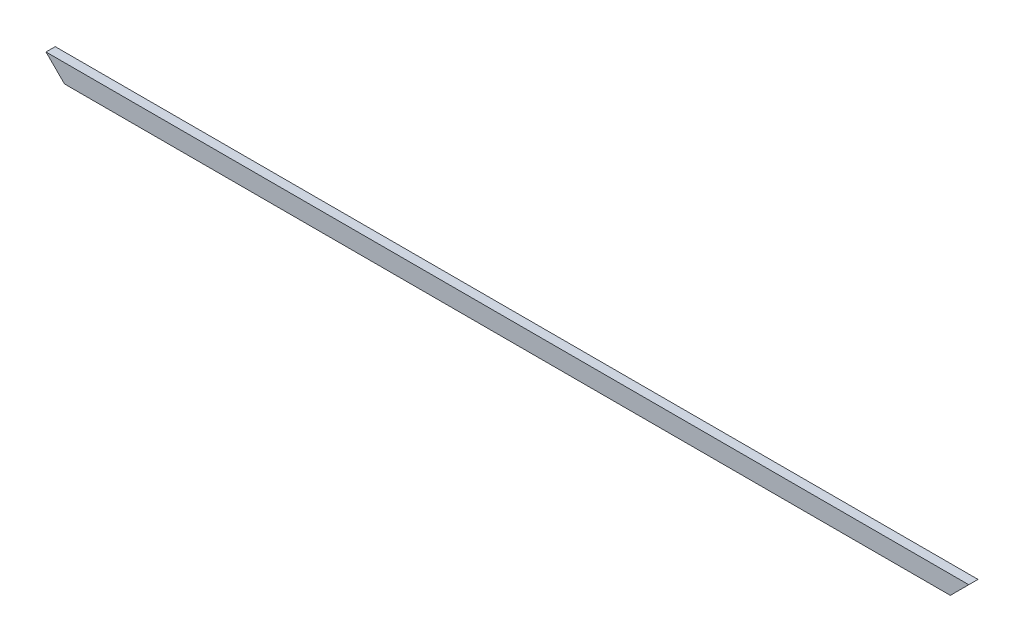
ISO-10303-21;
HEADER;
FILE_DESCRIPTION(('STEP AP214'),'2;1');
FILE_NAME('part.step','',(''),(''),'','','');
FILE_SCHEMA(('AUTOMOTIVE_DESIGN { 1 0 10303 214 1 1 1 1 }'));
ENDSEC;
DATA;
#1=APPLICATION_CONTEXT('core data for automotive mechanical design processes');
#2=APPLICATION_PROTOCOL_DEFINITION('international standard','automotive_design',2000,#1);
#3=PRODUCT_CONTEXT('',#1,'mechanical');
#4=PRODUCT('Part','Part','',(#3));
#5=PRODUCT_RELATED_PRODUCT_CATEGORY('part','',(#4));
#6=PRODUCT_DEFINITION_FORMATION('','',#4);
#7=PRODUCT_DEFINITION_CONTEXT('part definition',#1,'design');
#8=PRODUCT_DEFINITION('design','',#6,#7);
#9=PRODUCT_DEFINITION_SHAPE('','',#8);
#10=(LENGTH_UNIT() NAMED_UNIT(*) SI_UNIT(.MILLI.,.METRE.));
#11=(NAMED_UNIT(*) PLANE_ANGLE_UNIT() SI_UNIT($,.RADIAN.));
#12=(NAMED_UNIT(*) SI_UNIT($,.STERADIAN.) SOLID_ANGLE_UNIT());
#13=UNCERTAINTY_MEASURE_WITH_UNIT(LENGTH_MEASURE(1.E-05),#10,'distance_accuracy_value','');
#14=(GEOMETRIC_REPRESENTATION_CONTEXT(3) GLOBAL_UNCERTAINTY_ASSIGNED_CONTEXT((#13)) GLOBAL_UNIT_ASSIGNED_CONTEXT((#10,
#11,#12)) REPRESENTATION_CONTEXT('',''));
#15=CARTESIAN_POINT('',(0.,0.,0.));
#16=DIRECTION('',(0.,0.,1.));
#17=DIRECTION('',(1.,0.,0.));
#18=AXIS2_PLACEMENT_3D('',#15,#16,#17);
#19=CARTESIAN_POINT('',(20.0000000000001,20.,10.));
#20=DIRECTION('',(0.707106781186547,-0.707106781186548,0.));
#21=DIRECTION('',(0.707106781186548,0.707106781186547,0.));
#22=AXIS2_PLACEMENT_3D('',#19,#20,#21);
#23=PLANE('',#22);
#24=DIRECTION('',(-0.707106781186548,-0.707106781186547,0.));
#25=VECTOR('',#24,1.);
#26=CARTESIAN_POINT('',(20.0000000000001,20.,0.));
#27=LINE('',#26,#25);
#28=CARTESIAN_POINT('',(20.0000000000001,20.,0.));
#29=VERTEX_POINT('',#28);
#30=CARTESIAN_POINT('',(0.,0.,0.));
#31=VERTEX_POINT('',#30);
#32=EDGE_CURVE('E97',#29,#31,#27,.T.);
#33=ORIENTED_EDGE('',*,*,#32,.F.);
#34=DIRECTION('',(0.,0.,-1.));
#35=VECTOR('',#34,1.);
#36=CARTESIAN_POINT('',(20.0000000000001,20.,10.));
#37=LINE('',#36,#35);
#38=CARTESIAN_POINT('',(20.0000000000001,20.,10.));
#39=VERTEX_POINT('',#38);
#40=EDGE_CURVE('E11',#39,#29,#37,.T.);
#41=ORIENTED_EDGE('',*,*,#40,.F.);
#42=DIRECTION('',(-0.707106781186548,-0.707106781186547,0.));
#43=VECTOR('',#42,1.);
#44=CARTESIAN_POINT('',(20.0000000000001,20.,10.));
#45=LINE('',#44,#43);
#46=CARTESIAN_POINT('',(0.,0.,10.));
#47=VERTEX_POINT('',#46);
#48=EDGE_CURVE('E91',#39,#47,#45,.T.);
#49=ORIENTED_EDGE('',*,*,#48,.T.);
#50=DIRECTION('',(0.,0.,-1.));
#51=VECTOR('',#50,1.);
#52=CARTESIAN_POINT('',(0.,0.,10.));
#53=LINE('',#52,#51);
#54=EDGE_CURVE('E36',#47,#31,#53,.T.);
#55=ORIENTED_EDGE('',*,*,#54,.T.);
#56=EDGE_LOOP('',(#33,#41,#49,#55));
#57=FACE_BOUND('',#56,.T.);
#58=ADVANCED_FACE('F33',(#57),#23,.T.);
#59=CARTESIAN_POINT('',(-980.,20.,10.));
#60=DIRECTION('',(0.,1.,0.));
#61=DIRECTION('',(-1.,0.,0.));
#62=AXIS2_PLACEMENT_3D('',#59,#60,#61);
#63=PLANE('',#62);
#64=DIRECTION('',(1.,0.,0.));
#65=VECTOR('',#64,1.);
#66=CARTESIAN_POINT('',(-980.,20.,0.));
#67=LINE('',#66,#65);
#68=CARTESIAN_POINT('',(-980.,20.,0.));
#69=VERTEX_POINT('',#68);
#70=EDGE_CURVE('E93',#69,#29,#67,.T.);
#71=ORIENTED_EDGE('',*,*,#70,.F.);
#72=DIRECTION('',(0.,0.,-1.));
#73=VECTOR('',#72,1.);
#74=CARTESIAN_POINT('',(-980.,20.,10.));
#75=LINE('',#74,#73);
#76=CARTESIAN_POINT('',(-980.,20.,10.));
#77=VERTEX_POINT('',#76);
#78=EDGE_CURVE('E42',#77,#69,#75,.T.);
#79=ORIENTED_EDGE('',*,*,#78,.F.);
#80=DIRECTION('',(1.,0.,0.));
#81=VECTOR('',#80,1.);
#82=CARTESIAN_POINT('',(-980.,20.,10.));
#83=LINE('',#82,#81);
#84=EDGE_CURVE('E88',#77,#39,#83,.T.);
#85=ORIENTED_EDGE('',*,*,#84,.T.);
#86=ORIENTED_EDGE('',*,*,#40,.T.);
#87=EDGE_LOOP('',(#71,#79,#85,#86));
#88=FACE_BOUND('',#87,.T.);
#89=ADVANCED_FACE('F107',(#88),#63,.T.);
#90=CARTESIAN_POINT('',(-960.,-1.17566092718146E-13,10.));
#91=DIRECTION('',(-0.707106781186547,-0.707106781186548,0.));
#92=DIRECTION('',(0.707106781186548,-0.707106781186547,0.));
#93=AXIS2_PLACEMENT_3D('',#90,#91,#92);
#94=PLANE('',#93);
#95=DIRECTION('',(-0.707106781186548,0.707106781186547,0.));
#96=VECTOR('',#95,1.);
#97=CARTESIAN_POINT('',(-960.,-1.17566092718146E-13,0.));
#98=LINE('',#97,#96);
#99=CARTESIAN_POINT('',(-960.,-1.17566092718146E-13,0.));
#100=VERTEX_POINT('',#99);
#101=EDGE_CURVE('E83',#100,#69,#98,.T.);
#102=ORIENTED_EDGE('',*,*,#101,.F.);
#103=DIRECTION('',(0.,0.,-1.));
#104=VECTOR('',#103,1.);
#105=CARTESIAN_POINT('',(-960.,-1.17566092718146E-13,10.));
#106=LINE('',#105,#104);
#107=CARTESIAN_POINT('',(-960.,-1.17566092718146E-13,10.));
#108=VERTEX_POINT('',#107);
#109=EDGE_CURVE('E78',#108,#100,#106,.T.);
#110=ORIENTED_EDGE('',*,*,#109,.F.);
#111=DIRECTION('',(-0.707106781186548,0.707106781186547,0.));
#112=VECTOR('',#111,1.);
#113=CARTESIAN_POINT('',(-960.,-1.17566092718146E-13,10.));
#114=LINE('',#113,#112);
#115=EDGE_CURVE('E81',#108,#77,#114,.T.);
#116=ORIENTED_EDGE('',*,*,#115,.T.);
#117=ORIENTED_EDGE('',*,*,#78,.T.);
#118=EDGE_LOOP('',(#102,#110,#116,#117));
#119=FACE_BOUND('',#118,.T.);
#120=ADVANCED_FACE('F80',(#119),#94,.T.);
#121=CARTESIAN_POINT('',(0.,0.,10.));
#122=DIRECTION('',(0.,-1.,0.));
#123=DIRECTION('',(1.,0.,0.));
#124=AXIS2_PLACEMENT_3D('',#121,#122,#123);
#125=PLANE('',#124);
#126=DIRECTION('',(-1.,0.,0.));
#127=VECTOR('',#126,1.);
#128=CARTESIAN_POINT('',(0.,0.,0.));
#129=LINE('',#128,#127);
#130=EDGE_CURVE('E100',#31,#100,#129,.T.);
#131=ORIENTED_EDGE('',*,*,#130,.F.);
#132=ORIENTED_EDGE('',*,*,#54,.F.);
#133=DIRECTION('',(-1.,0.,0.));
#134=VECTOR('',#133,1.);
#135=CARTESIAN_POINT('',(0.,0.,10.));
#136=LINE('',#135,#134);
#137=EDGE_CURVE('E87',#47,#108,#136,.T.);
#138=ORIENTED_EDGE('',*,*,#137,.T.);
#139=ORIENTED_EDGE('',*,*,#109,.T.);
#140=EDGE_LOOP('',(#131,#132,#138,#139));
#141=FACE_BOUND('',#140,.T.);
#142=ADVANCED_FACE('F90',(#141),#125,.T.);
#143=CARTESIAN_POINT('',(0.,0.,10.));
#144=DIRECTION('',(0.,0.,-1.));
#145=DIRECTION('',(-1.,0.,0.));
#146=AXIS2_PLACEMENT_3D('',#143,#144,#145);
#147=PLANE('',#146);
#148=ORIENTED_EDGE('',*,*,#48,.F.);
#149=ORIENTED_EDGE('',*,*,#84,.F.);
#150=ORIENTED_EDGE('',*,*,#115,.F.);
#151=ORIENTED_EDGE('',*,*,#137,.F.);
#152=EDGE_LOOP('',(#148,#149,#150,#151));
#153=FACE_BOUND('',#152,.T.);
#154=ADVANCED_FACE('F86',(#153),#147,.F.);
#155=CARTESIAN_POINT('',(0.,0.,0.));
#156=DIRECTION('',(0.,0.,-1.));
#157=DIRECTION('',(-1.,0.,0.));
#158=AXIS2_PLACEMENT_3D('',#155,#156,#157);
#159=PLANE('',#158);
#160=ORIENTED_EDGE('',*,*,#32,.T.);
#161=ORIENTED_EDGE('',*,*,#130,.T.);
#162=ORIENTED_EDGE('',*,*,#101,.T.);
#163=ORIENTED_EDGE('',*,*,#70,.T.);
#164=EDGE_LOOP('',(#160,#161,#162,#163));
#165=FACE_BOUND('',#164,.T.);
#166=ADVANCED_FACE('F106',(#165),#159,.T.);
#167=CLOSED_SHELL('',(#58,#89,#120,#142,#154,#166));
#168=MANIFOLD_SOLID_BREP('B2',#167);
#169=ADVANCED_BREP_SHAPE_REPRESENTATION('',(#18,#168),#14);
#170=SHAPE_DEFINITION_REPRESENTATION(#9,#169);
ENDSEC;
END-ISO-10303-21;
